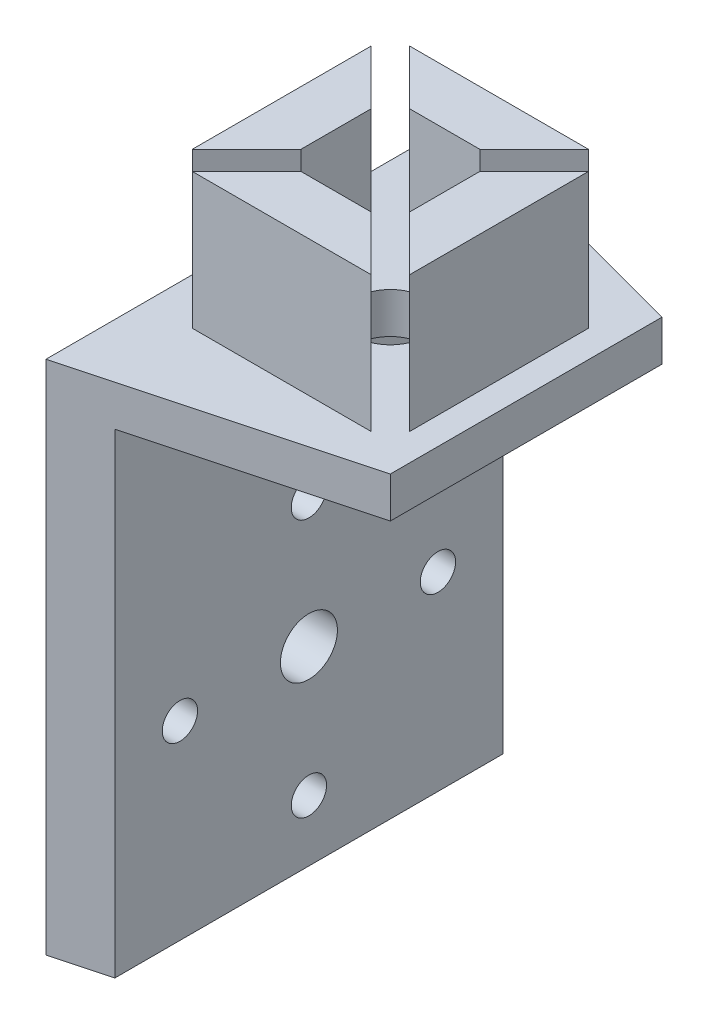
ISO-10303-21;
HEADER;
FILE_DESCRIPTION(('STEP AP214'),'2;1');
FILE_NAME('part.step','',(''),(''),'','','');
FILE_SCHEMA(('AUTOMOTIVE_DESIGN { 1 0 10303 214 1 1 1 1 }'));
ENDSEC;
DATA;
#1=APPLICATION_CONTEXT('core data for automotive mechanical design processes');
#2=APPLICATION_PROTOCOL_DEFINITION('international standard','automotive_design',2000,#1);
#3=PRODUCT_CONTEXT('',#1,'mechanical');
#4=PRODUCT('Part','Part','',(#3));
#5=PRODUCT_RELATED_PRODUCT_CATEGORY('part','',(#4));
#6=PRODUCT_DEFINITION_FORMATION('','',#4);
#7=PRODUCT_DEFINITION_CONTEXT('part definition',#1,'design');
#8=PRODUCT_DEFINITION('design','',#6,#7);
#9=PRODUCT_DEFINITION_SHAPE('','',#8);
#10=(LENGTH_UNIT() NAMED_UNIT(*) SI_UNIT(.MILLI.,.METRE.));
#11=(NAMED_UNIT(*) PLANE_ANGLE_UNIT() SI_UNIT($,.RADIAN.));
#12=(NAMED_UNIT(*) SI_UNIT($,.STERADIAN.) SOLID_ANGLE_UNIT());
#13=UNCERTAINTY_MEASURE_WITH_UNIT(LENGTH_MEASURE(1.E-05),#10,'distance_accuracy_value','');
#14=(GEOMETRIC_REPRESENTATION_CONTEXT(3) GLOBAL_UNCERTAINTY_ASSIGNED_CONTEXT((#13)) GLOBAL_UNIT_ASSIGNED_CONTEXT((#10,
#11,#12)) REPRESENTATION_CONTEXT('',''));
#15=CARTESIAN_POINT('',(0.,0.,0.));
#16=DIRECTION('',(0.,0.,1.));
#17=DIRECTION('',(1.,0.,0.));
#18=AXIS2_PLACEMENT_3D('',#15,#16,#17);
#19=CARTESIAN_POINT('',(0.,-150.,0.));
#20=DIRECTION('',(0.,-1.,0.));
#21=DIRECTION('',(0.,0.,-1.));
#22=AXIS2_PLACEMENT_3D('',#19,#20,#21);
#23=PLANE('',#22);
#24=DIRECTION('',(0.,0.,-1.));
#25=VECTOR('',#24,1.);
#26=CARTESIAN_POINT('',(123.,-150.,0.));
#27=LINE('',#26,#25);
#28=CARTESIAN_POINT('',(123.,-150.,56.585786437627));
#29=VERTEX_POINT('',#28);
#30=CARTESIAN_POINT('',(123.,-150.,43.4142135623731));
#31=VERTEX_POINT('',#30);
#32=EDGE_CURVE('E378',#29,#31,#27,.T.);
#33=ORIENTED_EDGE('',*,*,#32,.F.);
#34=DIRECTION('',(0.707106781186547,0.,0.707106781186548));
#35=VECTOR('',#34,1.);
#36=CARTESIAN_POINT('',(33.2071067811866,-150.,-33.2071067811865));
#37=LINE('',#36,#35);
#38=CARTESIAN_POINT('',(119.,-150.,52.5857864376269));
#39=VERTEX_POINT('',#38);
#40=EDGE_CURVE('E400',#39,#29,#37,.T.);
#41=ORIENTED_EDGE('',*,*,#40,.F.);
#42=DIRECTION('',(0.,0.,1.));
#43=VECTOR('',#42,1.);
#44=CARTESIAN_POINT('',(119.,-150.,0.));
#45=LINE('',#44,#43);
#46=CARTESIAN_POINT('',(119.,-150.,47.4142135623731));
#47=VERTEX_POINT('',#46);
#48=EDGE_CURVE('E403',#47,#39,#45,.T.);
#49=ORIENTED_EDGE('',*,*,#48,.F.);
#50=DIRECTION('',(-0.707106781186547,0.,0.707106781186548));
#51=VECTOR('',#50,1.);
#52=CARTESIAN_POINT('',(83.2071067811866,-150.,83.2071067811866));
#53=LINE('',#52,#51);
#54=EDGE_CURVE('E391',#31,#47,#53,.T.);
#55=ORIENTED_EDGE('',*,*,#54,.F.);
#56=EDGE_LOOP('',(#33,#41,#49,#55));
#57=FACE_BOUND('',#56,.T.);
#58=CARTESIAN_POINT('',(115.,-150.,50.));
#59=DIRECTION('',(0.,-1.,0.));
#60=DIRECTION('',(0.,0.,-1.));
#61=AXIS2_PLACEMENT_3D('',#58,#59,#60);
#62=CIRCLE('',#61,2.50000000000001);
#63=CARTESIAN_POINT('',(115.,-150.,47.5));
#64=VERTEX_POINT('',#63);
#65=EDGE_CURVE('E456',#64,#64,#62,.T.);
#66=ORIENTED_EDGE('',*,*,#65,.T.);
#67=EDGE_LOOP('',(#66));
#68=FACE_BOUND('',#67,.T.);
#69=DIRECTION('',(0.,0.,1.));
#70=VECTOR('',#69,1.);
#71=CARTESIAN_POINT('',(125.,-150.,0.));
#72=LINE('',#71,#70);
#73=CARTESIAN_POINT('',(125.,-150.,40.));
#74=VERTEX_POINT('',#73);
#75=CARTESIAN_POINT('',(125.,-150.,60.));
#76=VERTEX_POINT('',#75);
#77=EDGE_CURVE('E444',#74,#76,#72,.T.);
#78=ORIENTED_EDGE('',*,*,#77,.F.);
#79=DIRECTION('',(0.965925826289068,0.,0.258819045102521));
#80=VECTOR('',#79,1.);
#81=CARTESIAN_POINT('',(94.7450647757216,-150.,31.8932145395987));
#82=LINE('',#81,#80);
#83=CARTESIAN_POINT('',(105.,-150.,34.6410161513775));
#84=VERTEX_POINT('',#83);
#85=EDGE_CURVE('E344',#84,#74,#82,.T.);
#86=ORIENTED_EDGE('',*,*,#85,.F.);
#87=DIRECTION('',(0.,0.,-1.));
#88=VECTOR('',#87,1.);
#89=CARTESIAN_POINT('',(105.,-150.,0.));
#90=LINE('',#89,#88);
#91=CARTESIAN_POINT('',(105.,-150.,65.3589838486225));
#92=VERTEX_POINT('',#91);
#93=EDGE_CURVE('E461',#92,#84,#90,.T.);
#94=ORIENTED_EDGE('',*,*,#93,.F.);
#95=DIRECTION('',(-0.965925826289068,0.,0.258819045102521));
#96=VECTOR('',#95,1.);
#97=CARTESIAN_POINT('',(113.405318813566,-150.,63.1067854604013));
#98=LINE('',#97,#96);
#99=EDGE_CURVE('E338',#76,#92,#98,.T.);
#100=ORIENTED_EDGE('',*,*,#99,.F.);
#101=EDGE_LOOP('',(#78,#86,#94,#100));
#102=FACE_BOUND('',#101,.T.);
#103=DIRECTION('',(1.,0.,0.));
#104=VECTOR('',#103,1.);
#105=CARTESIAN_POINT('',(0.,-150.,58.0000000000001));
#106=LINE('',#105,#104);
#107=CARTESIAN_POINT('',(108.414213562373,-150.,58.0000000000001));
#108=VERTEX_POINT('',#107);
#109=CARTESIAN_POINT('',(121.585786437627,-150.,58.));
#110=VERTEX_POINT('',#109);
#111=EDGE_CURVE('E469',#108,#110,#106,.T.);
#112=ORIENTED_EDGE('',*,*,#111,.F.);
#113=DIRECTION('',(-0.707106781186548,0.,0.707106781186548));
#114=VECTOR('',#113,1.);
#115=CARTESIAN_POINT('',(83.2071067811866,-150.,83.2071067811866));
#116=LINE('',#115,#114);
#117=CARTESIAN_POINT('',(112.414213562373,-150.,54.));
#118=VERTEX_POINT('',#117);
#119=EDGE_CURVE('E482',#118,#108,#116,.T.);
#120=ORIENTED_EDGE('',*,*,#119,.F.);
#121=DIRECTION('',(-1.,0.,0.));
#122=VECTOR('',#121,1.);
#123=CARTESIAN_POINT('',(0.,-150.,54.));
#124=LINE('',#123,#122);
#125=CARTESIAN_POINT('',(117.585786437627,-150.,54.));
#126=VERTEX_POINT('',#125);
#127=EDGE_CURVE('E485',#126,#118,#124,.T.);
#128=ORIENTED_EDGE('',*,*,#127,.F.);
#129=DIRECTION('',(-0.707106781186548,0.,-0.707106781186547));
#130=VECTOR('',#129,1.);
#131=CARTESIAN_POINT('',(31.7928932188134,-150.,-31.7928932188134));
#132=LINE('',#131,#130);
#133=EDGE_CURVE('E474',#110,#126,#132,.T.);
#134=ORIENTED_EDGE('',*,*,#133,.F.);
#135=EDGE_LOOP('',(#112,#120,#128,#134));
#136=FACE_BOUND('',#135,.T.);
#137=DIRECTION('',(0.,0.,1.));
#138=VECTOR('',#137,1.);
#139=CARTESIAN_POINT('',(107.000000000001,-150.,1.06498441743828E-12));
#140=LINE('',#139,#138);
#141=CARTESIAN_POINT('',(107.,-150.,43.4142135623731));
#142=VERTEX_POINT('',#141);
#143=CARTESIAN_POINT('',(107.,-150.,56.585786437627));
#144=VERTEX_POINT('',#143);
#145=EDGE_CURVE('E411',#142,#144,#140,.T.);
#146=ORIENTED_EDGE('',*,*,#145,.F.);
#147=DIRECTION('',(-0.707106781186547,0.,-0.707106781186548));
#148=VECTOR('',#147,1.);
#149=CARTESIAN_POINT('',(31.7928932188135,-150.,-31.7928932188135));
#150=LINE('',#149,#148);
#151=CARTESIAN_POINT('',(111.,-150.,47.4142135623731));
#152=VERTEX_POINT('',#151);
#153=EDGE_CURVE('E433',#152,#142,#150,.T.);
#154=ORIENTED_EDGE('',*,*,#153,.F.);
#155=DIRECTION('',(0.,0.,-1.));
#156=VECTOR('',#155,1.);
#157=CARTESIAN_POINT('',(111.,-150.,0.));
#158=LINE('',#157,#156);
#159=CARTESIAN_POINT('',(111.,-150.,52.5857864376269));
#160=VERTEX_POINT('',#159);
#161=EDGE_CURVE('E436',#160,#152,#158,.T.);
#162=ORIENTED_EDGE('',*,*,#161,.F.);
#163=DIRECTION('',(0.707106781186547,0.,-0.707106781186548));
#164=VECTOR('',#163,1.);
#165=CARTESIAN_POINT('',(81.7928932188135,-150.,81.7928932188134));
#166=LINE('',#165,#164);
#167=EDGE_CURVE('E424',#144,#160,#166,.T.);
#168=ORIENTED_EDGE('',*,*,#167,.F.);
#169=EDGE_LOOP('',(#146,#154,#162,#168));
#170=FACE_BOUND('',#169,.T.);
#171=DIRECTION('',(-1.,0.,0.));
#172=VECTOR('',#171,1.);
#173=CARTESIAN_POINT('',(0.,-150.,42.));
#174=LINE('',#173,#172);
#175=CARTESIAN_POINT('',(121.585786437627,-150.,42.));
#176=VERTEX_POINT('',#175);
#177=CARTESIAN_POINT('',(108.414213562373,-150.,42.));
#178=VERTEX_POINT('',#177);
#179=EDGE_CURVE('E357',#176,#178,#174,.T.);
#180=ORIENTED_EDGE('',*,*,#179,.F.);
#181=DIRECTION('',(0.707106781186548,0.,-0.707106781186547));
#182=VECTOR('',#181,1.);
#183=CARTESIAN_POINT('',(81.7928932188135,-150.,81.7928932188135));
#184=LINE('',#183,#182);
#185=CARTESIAN_POINT('',(117.585786437627,-150.,46.));
#186=VERTEX_POINT('',#185);
#187=EDGE_CURVE('E371',#186,#176,#184,.T.);
#188=ORIENTED_EDGE('',*,*,#187,.F.);
#189=DIRECTION('',(1.,0.,0.));
#190=VECTOR('',#189,1.);
#191=CARTESIAN_POINT('',(0.,-150.,46.));
#192=LINE('',#191,#190);
#193=CARTESIAN_POINT('',(112.414213562373,-150.,46.));
#194=VERTEX_POINT('',#193);
#195=EDGE_CURVE('E187',#194,#186,#192,.T.);
#196=ORIENTED_EDGE('',*,*,#195,.F.);
#197=DIRECTION('',(0.707106781186548,0.,0.707106781186548));
#198=VECTOR('',#197,1.);
#199=CARTESIAN_POINT('',(33.2071067811865,-150.,-33.2071067811865));
#200=LINE('',#199,#198);
#201=EDGE_CURVE('E182',#178,#194,#200,.T.);
#202=ORIENTED_EDGE('',*,*,#201,.F.);
#203=EDGE_LOOP('',(#180,#188,#196,#202));
#204=FACE_BOUND('',#203,.T.);
#205=ADVANCED_FACE('F165',(#57,#68,#102,#136,#170,#204),#23,.F.);
#206=CARTESIAN_POINT('',(0.,-140.,58.0000000000001));
#207=DIRECTION('',(0.,0.,-1.));
#208=DIRECTION('',(-1.,0.,0.));
#209=AXIS2_PLACEMENT_3D('',#206,#207,#208);
#210=PLANE('',#209);
#211=ORIENTED_EDGE('',*,*,#111,.T.);
#212=DIRECTION('',(0.,-1.,0.));
#213=VECTOR('',#212,1.);
#214=CARTESIAN_POINT('',(121.585786437627,-140.,58.));
#215=LINE('',#214,#213);
#216=CARTESIAN_POINT('',(121.585786437627,-140.,58.));
#217=VERTEX_POINT('',#216);
#218=EDGE_CURVE('E12',#217,#110,#215,.T.);
#219=ORIENTED_EDGE('',*,*,#218,.F.);
#220=DIRECTION('',(1.,0.,0.));
#221=VECTOR('',#220,1.);
#222=CARTESIAN_POINT('',(0.,-140.,58.0000000000001));
#223=LINE('',#222,#221);
#224=CARTESIAN_POINT('',(108.414213562373,-140.,58.0000000000001));
#225=VERTEX_POINT('',#224);
#226=EDGE_CURVE('E470',#225,#217,#223,.T.);
#227=ORIENTED_EDGE('',*,*,#226,.F.);
#228=DIRECTION('',(0.,-1.,0.));
#229=VECTOR('',#228,1.);
#230=CARTESIAN_POINT('',(108.414213562373,-140.,58.0000000000001));
#231=LINE('',#230,#229);
#232=EDGE_CURVE('E169',#225,#108,#231,.T.);
#233=ORIENTED_EDGE('',*,*,#232,.T.);
#234=EDGE_LOOP('',(#211,#219,#227,#233));
#235=FACE_BOUND('',#234,.T.);
#236=ADVANCED_FACE('F167',(#235),#210,.F.);
#237=CARTESIAN_POINT('',(31.7928932188134,-140.,-31.7928932188134));
#238=DIRECTION('',(-0.707106781186547,0.,0.707106781186548));
#239=DIRECTION('',(0.707106781186548,0.,0.707106781186547));
#240=AXIS2_PLACEMENT_3D('',#237,#238,#239);
#241=PLANE('',#240);
#242=ORIENTED_EDGE('',*,*,#133,.T.);
#243=DIRECTION('',(0.,-1.,0.));
#244=VECTOR('',#243,1.);
#245=CARTESIAN_POINT('',(117.585786437627,-140.,54.));
#246=LINE('',#245,#244);
#247=CARTESIAN_POINT('',(117.585786437627,-140.,54.));
#248=VERTEX_POINT('',#247);
#249=EDGE_CURVE('E174',#248,#126,#246,.T.);
#250=ORIENTED_EDGE('',*,*,#249,.F.);
#251=DIRECTION('',(-0.707106781186548,0.,-0.707106781186547));
#252=VECTOR('',#251,1.);
#253=CARTESIAN_POINT('',(31.7928932188134,-140.,-31.7928932188134));
#254=LINE('',#253,#252);
#255=EDGE_CURVE('E478',#217,#248,#254,.T.);
#256=ORIENTED_EDGE('',*,*,#255,.F.);
#257=ORIENTED_EDGE('',*,*,#218,.T.);
#258=EDGE_LOOP('',(#242,#250,#256,#257));
#259=FACE_BOUND('',#258,.T.);
#260=ADVANCED_FACE('F509',(#259),#241,.F.);
#261=CARTESIAN_POINT('',(0.,-140.,54.));
#262=DIRECTION('',(0.,0.,1.));
#263=DIRECTION('',(1.,0.,0.));
#264=AXIS2_PLACEMENT_3D('',#261,#262,#263);
#265=PLANE('',#264);
#266=ORIENTED_EDGE('',*,*,#127,.T.);
#267=DIRECTION('',(0.,-1.,0.));
#268=VECTOR('',#267,1.);
#269=CARTESIAN_POINT('',(112.414213562373,-140.,54.));
#270=LINE('',#269,#268);
#271=CARTESIAN_POINT('',(112.414213562373,-140.,54.));
#272=VERTEX_POINT('',#271);
#273=EDGE_CURVE('E491',#272,#118,#270,.T.);
#274=ORIENTED_EDGE('',*,*,#273,.F.);
#275=DIRECTION('',(-1.,0.,0.));
#276=VECTOR('',#275,1.);
#277=CARTESIAN_POINT('',(0.,-140.,54.));
#278=LINE('',#277,#276);
#279=EDGE_CURVE('E476',#248,#272,#278,.T.);
#280=ORIENTED_EDGE('',*,*,#279,.F.);
#281=ORIENTED_EDGE('',*,*,#249,.T.);
#282=EDGE_LOOP('',(#266,#274,#280,#281));
#283=FACE_BOUND('',#282,.T.);
#284=ADVANCED_FACE('F505',(#283),#265,.F.);
#285=CARTESIAN_POINT('',(83.2071067811866,-140.,83.2071067811866));
#286=DIRECTION('',(0.707106781186548,0.,0.707106781186548));
#287=DIRECTION('',(0.707106781186548,0.,-0.707106781186548));
#288=AXIS2_PLACEMENT_3D('',#285,#286,#287);
#289=PLANE('',#288);
#290=ORIENTED_EDGE('',*,*,#119,.T.);
#291=ORIENTED_EDGE('',*,*,#232,.F.);
#292=DIRECTION('',(-0.707106781186548,0.,0.707106781186548));
#293=VECTOR('',#292,1.);
#294=CARTESIAN_POINT('',(83.2071067811866,-140.,83.2071067811866));
#295=LINE('',#294,#293);
#296=EDGE_CURVE('E473',#272,#225,#295,.T.);
#297=ORIENTED_EDGE('',*,*,#296,.F.);
#298=ORIENTED_EDGE('',*,*,#273,.T.);
#299=EDGE_LOOP('',(#290,#291,#297,#298));
#300=FACE_BOUND('',#299,.T.);
#301=ADVANCED_FACE('F501',(#300),#289,.F.);
#302=CARTESIAN_POINT('',(0.,-140.,0.));
#303=DIRECTION('',(0.,-1.,0.));
#304=DIRECTION('',(0.,0.,-1.));
#305=AXIS2_PLACEMENT_3D('',#302,#303,#304);
#306=PLANE('',#305);
#307=ORIENTED_EDGE('',*,*,#226,.T.);
#308=ORIENTED_EDGE('',*,*,#255,.T.);
#309=ORIENTED_EDGE('',*,*,#279,.T.);
#310=ORIENTED_EDGE('',*,*,#296,.T.);
#311=EDGE_LOOP('',(#307,#308,#309,#310));
#312=FACE_BOUND('',#311,.T.);
#313=ADVANCED_FACE('F511',(#312),#306,.F.);
#314=CARTESIAN_POINT('',(115.,-153.,50.));
#315=DIRECTION('',(0.,1.,0.));
#316=DIRECTION('',(0.,0.,1.));
#317=AXIS2_PLACEMENT_3D('',#314,#315,#316);
#318=CYLINDRICAL_SURFACE('',#317,2.50000000000001);
#319=CARTESIAN_POINT('',(115.,-153.,50.));
#320=DIRECTION('',(0.,-1.,0.));
#321=DIRECTION('',(0.,0.,-1.));
#322=AXIS2_PLACEMENT_3D('',#319,#320,#321);
#323=CIRCLE('',#322,2.50000000000001);
#324=CARTESIAN_POINT('',(115.,-153.,47.5));
#325=VERTEX_POINT('',#324);
#326=EDGE_CURVE('E455',#325,#325,#323,.T.);
#327=ORIENTED_EDGE('',*,*,#326,.T.);
#328=EDGE_LOOP('',(#327));
#329=FACE_BOUND('',#328,.T.);
#330=ORIENTED_EDGE('',*,*,#65,.F.);
#331=EDGE_LOOP('',(#330));
#332=FACE_BOUND('',#331,.T.);
#333=ADVANCED_FACE('F513',(#329,#332),#318,.F.);
#334=CARTESIAN_POINT('',(125.,-153.,0.));
#335=DIRECTION('',(-1.,0.,0.));
#336=DIRECTION('',(0.,0.,1.));
#337=AXIS2_PLACEMENT_3D('',#334,#335,#336);
#338=PLANE('',#337);
#339=ORIENTED_EDGE('',*,*,#77,.T.);
#340=DIRECTION('',(0.,1.,0.));
#341=VECTOR('',#340,1.);
#342=CARTESIAN_POINT('',(125.,-153.,60.));
#343=LINE('',#342,#341);
#344=CARTESIAN_POINT('',(125.,-153.,60.));
#345=VERTEX_POINT('',#344);
#346=EDGE_CURVE('E459',#345,#76,#343,.T.);
#347=ORIENTED_EDGE('',*,*,#346,.F.);
#348=DIRECTION('',(0.,0.,1.));
#349=VECTOR('',#348,1.);
#350=CARTESIAN_POINT('',(125.,-153.,0.));
#351=LINE('',#350,#349);
#352=CARTESIAN_POINT('',(125.,-153.,40.));
#353=VERTEX_POINT('',#352);
#354=EDGE_CURVE('E453',#353,#345,#351,.T.);
#355=ORIENTED_EDGE('',*,*,#354,.F.);
#356=DIRECTION('',(0.,1.,0.));
#357=VECTOR('',#356,1.);
#358=CARTESIAN_POINT('',(125.,-153.,40.));
#359=LINE('',#358,#357);
#360=EDGE_CURVE('E466',#353,#74,#359,.T.);
#361=ORIENTED_EDGE('',*,*,#360,.T.);
#362=EDGE_LOOP('',(#339,#347,#355,#361));
#363=FACE_BOUND('',#362,.T.);
#364=ADVANCED_FACE('F519',(#363),#338,.F.);
#365=CARTESIAN_POINT('',(105.,-153.,0.));
#366=DIRECTION('',(1.,0.,0.));
#367=DIRECTION('',(0.,0.,-1.));
#368=AXIS2_PLACEMENT_3D('',#365,#366,#367);
#369=PLANE('',#368);
#370=CARTESIAN_POINT('',(105.,-174.,50.));
#371=DIRECTION('',(1.,0.,0.));
#372=DIRECTION('',(0.,0.,-1.));
#373=AXIS2_PLACEMENT_3D('',#370,#371,#372);
#374=CIRCLE('',#373,2.09999999999999);
#375=CARTESIAN_POINT('',(105.,-174.,47.9));
#376=VERTEX_POINT('',#375);
#377=EDGE_CURVE('E561',#376,#376,#374,.T.);
#378=ORIENTED_EDGE('',*,*,#377,.T.);
#379=EDGE_LOOP('',(#378));
#380=FACE_BOUND('',#379,.T.);
#381=CARTESIAN_POINT('',(105.,-164.5,50.));
#382=DIRECTION('',(1.,0.,0.));
#383=DIRECTION('',(0.,0.,-1.));
#384=AXIS2_PLACEMENT_3D('',#381,#382,#383);
#385=CIRCLE('',#384,1.29999999999999);
#386=CARTESIAN_POINT('',(105.,-164.5,48.7));
#387=VERTEX_POINT('',#386);
#388=EDGE_CURVE('E571',#387,#387,#385,.T.);
#389=ORIENTED_EDGE('',*,*,#388,.T.);
#390=EDGE_LOOP('',(#389));
#391=FACE_BOUND('',#390,.T.);
#392=CARTESIAN_POINT('',(105.,-174.,40.5));
#393=DIRECTION('',(1.,0.,0.));
#394=DIRECTION('',(0.,0.,-1.));
#395=AXIS2_PLACEMENT_3D('',#392,#393,#394);
#396=CIRCLE('',#395,1.29999999999998);
#397=CARTESIAN_POINT('',(105.,-174.,39.2000000000001));
#398=VERTEX_POINT('',#397);
#399=EDGE_CURVE('E568',#398,#398,#396,.T.);
#400=ORIENTED_EDGE('',*,*,#399,.T.);
#401=EDGE_LOOP('',(#400));
#402=FACE_BOUND('',#401,.T.);
#403=CARTESIAN_POINT('',(105.,-183.5,50.));
#404=DIRECTION('',(1.,0.,0.));
#405=DIRECTION('',(0.,0.,-1.));
#406=AXIS2_PLACEMENT_3D('',#403,#404,#405);
#407=CIRCLE('',#406,1.29999999999999);
#408=CARTESIAN_POINT('',(105.,-183.5,48.7));
#409=VERTEX_POINT('',#408);
#410=EDGE_CURVE('E562',#409,#409,#407,.T.);
#411=ORIENTED_EDGE('',*,*,#410,.T.);
#412=EDGE_LOOP('',(#411));
#413=FACE_BOUND('',#412,.T.);
#414=CARTESIAN_POINT('',(105.,-174.,59.5));
#415=DIRECTION('',(1.,0.,0.));
#416=DIRECTION('',(0.,0.,-1.));
#417=AXIS2_PLACEMENT_3D('',#414,#415,#416);
#418=CIRCLE('',#417,1.30000000000001);
#419=CARTESIAN_POINT('',(105.,-174.,58.2));
#420=VERTEX_POINT('',#419);
#421=EDGE_CURVE('E554',#420,#420,#418,.T.);
#422=ORIENTED_EDGE('',*,*,#421,.T.);
#423=EDGE_LOOP('',(#422));
#424=FACE_BOUND('',#423,.T.);
#425=ORIENTED_EDGE('',*,*,#93,.T.);
#426=DIRECTION('',(0.,1.,0.));
#427=VECTOR('',#426,1.);
#428=CARTESIAN_POINT('',(105.,-188.,34.6410161513775));
#429=LINE('',#428,#427);
#430=CARTESIAN_POINT('',(105.,-188.,34.6410161513775));
#431=VERTEX_POINT('',#430);
#432=EDGE_CURVE('E321',#431,#84,#429,.T.);
#433=ORIENTED_EDGE('',*,*,#432,.F.);
#434=DIRECTION('',(0.,0.,-1.));
#435=VECTOR('',#434,1.);
#436=CARTESIAN_POINT('',(105.,-188.,40.));
#437=LINE('',#436,#435);
#438=CARTESIAN_POINT('',(105.,-188.,65.3589838486225));
#439=VERTEX_POINT('',#438);
#440=EDGE_CURVE('E314',#439,#431,#437,.T.);
#441=ORIENTED_EDGE('',*,*,#440,.F.);
#442=DIRECTION('',(0.,-1.,0.));
#443=VECTOR('',#442,1.);
#444=CARTESIAN_POINT('',(105.,-150.,65.3589838486225));
#445=LINE('',#444,#443);
#446=EDGE_CURVE('E318',#92,#439,#445,.T.);
#447=ORIENTED_EDGE('',*,*,#446,.F.);
#448=EDGE_LOOP('',(#425,#433,#441,#447));
#449=FACE_BOUND('',#448,.T.);
#450=ADVANCED_FACE('F316',(#380,#391,#402,#413,#424,#449),#369,.F.);
#451=CARTESIAN_POINT('',(0.,-153.,0.));
#452=DIRECTION('',(0.,-1.,0.));
#453=DIRECTION('',(0.,0.,-1.));
#454=AXIS2_PLACEMENT_3D('',#451,#452,#453);
#455=PLANE('',#454);
#456=DIRECTION('',(0.,0.,1.));
#457=VECTOR('',#456,1.);
#458=CARTESIAN_POINT('',(109.,-153.,40.));
#459=LINE('',#458,#457);
#460=CARTESIAN_POINT('',(109.,-153.,35.712812921102));
#461=VERTEX_POINT('',#460);
#462=CARTESIAN_POINT('',(109.,-153.,64.287187078898));
#463=VERTEX_POINT('',#462);
#464=EDGE_CURVE('E326',#461,#463,#459,.T.);
#465=ORIENTED_EDGE('',*,*,#464,.F.);
#466=DIRECTION('',(-0.965925826289068,0.,-0.258819045102521));
#467=VECTOR('',#466,1.);
#468=CARTESIAN_POINT('',(98.4771155832905,-153.,32.8932145395987));
#469=LINE('',#468,#467);
#470=EDGE_CURVE('E347',#353,#461,#469,.T.);
#471=ORIENTED_EDGE('',*,*,#470,.F.);
#472=ORIENTED_EDGE('',*,*,#354,.T.);
#473=DIRECTION('',(0.965925826289068,0.,-0.258819045102521));
#474=VECTOR('',#473,1.);
#475=CARTESIAN_POINT('',(98.4771155832905,-153.,67.1067854604013));
#476=LINE('',#475,#474);
#477=EDGE_CURVE('E340',#463,#345,#476,.T.);
#478=ORIENTED_EDGE('',*,*,#477,.F.);
#479=EDGE_LOOP('',(#465,#471,#472,#478));
#480=FACE_BOUND('',#479,.T.);
#481=ORIENTED_EDGE('',*,*,#326,.F.);
#482=EDGE_LOOP('',(#481));
#483=FACE_BOUND('',#482,.T.);
#484=ADVANCED_FACE('F534',(#480,#483),#455,.T.);
#485=CARTESIAN_POINT('',(107.000000000001,-140.,1.06498441743828E-12));
#486=DIRECTION('',(1.,0.,0.));
#487=DIRECTION('',(0.,0.,-1.));
#488=AXIS2_PLACEMENT_3D('',#485,#486,#487);
#489=PLANE('',#488);
#490=ORIENTED_EDGE('',*,*,#145,.T.);
#491=DIRECTION('',(0.,-1.,0.));
#492=VECTOR('',#491,1.);
#493=CARTESIAN_POINT('',(107.,-140.,56.585786437627));
#494=LINE('',#493,#492);
#495=CARTESIAN_POINT('',(107.,-140.,56.585786437627));
#496=VERTEX_POINT('',#495);
#497=EDGE_CURVE('E441',#496,#144,#494,.T.);
#498=ORIENTED_EDGE('',*,*,#497,.F.);
#499=DIRECTION('',(0.,0.,1.));
#500=VECTOR('',#499,1.);
#501=CARTESIAN_POINT('',(107.000000000001,-140.,1.06498441743828E-12));
#502=LINE('',#501,#500);
#503=CARTESIAN_POINT('',(107.,-140.,43.4142135623731));
#504=VERTEX_POINT('',#503);
#505=EDGE_CURVE('E420',#504,#496,#502,.T.);
#506=ORIENTED_EDGE('',*,*,#505,.F.);
#507=DIRECTION('',(0.,-1.,0.));
#508=VECTOR('',#507,1.);
#509=CARTESIAN_POINT('',(107.,-140.,43.4142135623731));
#510=LINE('',#509,#508);
#511=EDGE_CURVE('E430',#504,#142,#510,.T.);
#512=ORIENTED_EDGE('',*,*,#511,.T.);
#513=EDGE_LOOP('',(#490,#498,#506,#512));
#514=FACE_BOUND('',#513,.T.);
#515=ADVANCED_FACE('F668',(#514),#489,.F.);
#516=CARTESIAN_POINT('',(81.7928932188135,-140.,81.7928932188134));
#517=DIRECTION('',(-0.707106781186548,0.,-0.707106781186547));
#518=DIRECTION('',(-0.707106781186547,0.,0.707106781186548));
#519=AXIS2_PLACEMENT_3D('',#516,#517,#518);
#520=PLANE('',#519);
#521=ORIENTED_EDGE('',*,*,#167,.T.);
#522=DIRECTION('',(0.,-1.,0.));
#523=VECTOR('',#522,1.);
#524=CARTESIAN_POINT('',(111.,-140.,52.5857864376269));
#525=LINE('',#524,#523);
#526=CARTESIAN_POINT('',(111.,-140.,52.5857864376269));
#527=VERTEX_POINT('',#526);
#528=EDGE_CURVE('E445',#527,#160,#525,.T.);
#529=ORIENTED_EDGE('',*,*,#528,.F.);
#530=DIRECTION('',(0.707106781186547,0.,-0.707106781186548));
#531=VECTOR('',#530,1.);
#532=CARTESIAN_POINT('',(81.7928932188135,-140.,81.7928932188134));
#533=LINE('',#532,#531);
#534=EDGE_CURVE('E428',#496,#527,#533,.T.);
#535=ORIENTED_EDGE('',*,*,#534,.F.);
#536=ORIENTED_EDGE('',*,*,#497,.T.);
#537=EDGE_LOOP('',(#521,#529,#535,#536));
#538=FACE_BOUND('',#537,.T.);
#539=ADVANCED_FACE('F664',(#538),#520,.F.);
#540=CARTESIAN_POINT('',(111.,-140.,0.));
#541=DIRECTION('',(-1.,0.,0.));
#542=DIRECTION('',(0.,0.,1.));
#543=AXIS2_PLACEMENT_3D('',#540,#541,#542);
#544=PLANE('',#543);
#545=ORIENTED_EDGE('',*,*,#161,.T.);
#546=DIRECTION('',(0.,-1.,0.));
#547=VECTOR('',#546,1.);
#548=CARTESIAN_POINT('',(111.,-140.,47.4142135623731));
#549=LINE('',#548,#547);
#550=CARTESIAN_POINT('',(111.,-140.,47.4142135623731));
#551=VERTEX_POINT('',#550);
#552=EDGE_CURVE('E448',#551,#152,#549,.T.);
#553=ORIENTED_EDGE('',*,*,#552,.F.);
#554=DIRECTION('',(0.,0.,-1.));
#555=VECTOR('',#554,1.);
#556=CARTESIAN_POINT('',(111.,-140.,0.));
#557=LINE('',#556,#555);
#558=EDGE_CURVE('E426',#527,#551,#557,.T.);
#559=ORIENTED_EDGE('',*,*,#558,.F.);
#560=ORIENTED_EDGE('',*,*,#528,.T.);
#561=EDGE_LOOP('',(#545,#553,#559,#560));
#562=FACE_BOUND('',#561,.T.);
#563=ADVANCED_FACE('F667',(#562),#544,.F.);
#564=CARTESIAN_POINT('',(31.7928932188135,-140.,-31.7928932188135));
#565=DIRECTION('',(-0.707106781186548,0.,0.707106781186547));
#566=DIRECTION('',(0.707106781186547,0.,0.707106781186548));
#567=AXIS2_PLACEMENT_3D('',#564,#565,#566);
#568=PLANE('',#567);
#569=ORIENTED_EDGE('',*,*,#153,.T.);
#570=ORIENTED_EDGE('',*,*,#511,.F.);
#571=DIRECTION('',(-0.707106781186547,0.,-0.707106781186548));
#572=VECTOR('',#571,1.);
#573=CARTESIAN_POINT('',(31.7928932188135,-140.,-31.7928932188135));
#574=LINE('',#573,#572);
#575=EDGE_CURVE('E423',#551,#504,#574,.T.);
#576=ORIENTED_EDGE('',*,*,#575,.F.);
#577=ORIENTED_EDGE('',*,*,#552,.T.);
#578=EDGE_LOOP('',(#569,#570,#576,#577));
#579=FACE_BOUND('',#578,.T.);
#580=ADVANCED_FACE('F662',(#579),#568,.F.);
#581=CARTESIAN_POINT('',(0.,-140.,0.));
#582=DIRECTION('',(0.,-1.,0.));
#583=DIRECTION('',(0.,0.,-1.));
#584=AXIS2_PLACEMENT_3D('',#581,#582,#583);
#585=PLANE('',#584);
#586=ORIENTED_EDGE('',*,*,#505,.T.);
#587=ORIENTED_EDGE('',*,*,#534,.T.);
#588=ORIENTED_EDGE('',*,*,#558,.T.);
#589=ORIENTED_EDGE('',*,*,#575,.T.);
#590=EDGE_LOOP('',(#586,#587,#588,#589));
#591=FACE_BOUND('',#590,.T.);
#592=ADVANCED_FACE('F658',(#591),#585,.F.);
#593=CARTESIAN_POINT('',(123.,-140.,0.));
#594=DIRECTION('',(-1.,0.,0.));
#595=DIRECTION('',(0.,0.,1.));
#596=AXIS2_PLACEMENT_3D('',#593,#594,#595);
#597=PLANE('',#596);
#598=ORIENTED_EDGE('',*,*,#32,.T.);
#599=DIRECTION('',(0.,-1.,0.));
#600=VECTOR('',#599,1.);
#601=CARTESIAN_POINT('',(123.,-140.,43.4142135623731));
#602=LINE('',#601,#600);
#603=CARTESIAN_POINT('',(123.,-140.,43.4142135623731));
#604=VERTEX_POINT('',#603);
#605=EDGE_CURVE('E408',#604,#31,#602,.T.);
#606=ORIENTED_EDGE('',*,*,#605,.F.);
#607=DIRECTION('',(0.,0.,-1.));
#608=VECTOR('',#607,1.);
#609=CARTESIAN_POINT('',(123.,-140.,0.));
#610=LINE('',#609,#608);
#611=CARTESIAN_POINT('',(123.,-140.,56.585786437627));
#612=VERTEX_POINT('',#611);
#613=EDGE_CURVE('E387',#612,#604,#610,.T.);
#614=ORIENTED_EDGE('',*,*,#613,.F.);
#615=DIRECTION('',(0.,-1.,0.));
#616=VECTOR('',#615,1.);
#617=CARTESIAN_POINT('',(123.,-140.,56.585786437627));
#618=LINE('',#617,#616);
#619=EDGE_CURVE('E397',#612,#29,#618,.T.);
#620=ORIENTED_EDGE('',*,*,#619,.T.);
#621=EDGE_LOOP('',(#598,#606,#614,#620));
#622=FACE_BOUND('',#621,.T.);
#623=ADVANCED_FACE('F648',(#622),#597,.F.);
#624=CARTESIAN_POINT('',(83.2071067811866,-140.,83.2071067811866));
#625=DIRECTION('',(0.707106781186548,0.,0.707106781186547));
#626=DIRECTION('',(0.707106781186547,0.,-0.707106781186548));
#627=AXIS2_PLACEMENT_3D('',#624,#625,#626);
#628=PLANE('',#627);
#629=ORIENTED_EDGE('',*,*,#54,.T.);
#630=DIRECTION('',(0.,-1.,0.));
#631=VECTOR('',#630,1.);
#632=CARTESIAN_POINT('',(119.,-140.,47.4142135623731));
#633=LINE('',#632,#631);
#634=CARTESIAN_POINT('',(119.,-140.,47.4142135623731));
#635=VERTEX_POINT('',#634);
#636=EDGE_CURVE('E412',#635,#47,#633,.T.);
#637=ORIENTED_EDGE('',*,*,#636,.F.);
#638=DIRECTION('',(-0.707106781186547,0.,0.707106781186548));
#639=VECTOR('',#638,1.);
#640=CARTESIAN_POINT('',(83.2071067811866,-140.,83.2071067811866));
#641=LINE('',#640,#639);
#642=EDGE_CURVE('E395',#604,#635,#641,.T.);
#643=ORIENTED_EDGE('',*,*,#642,.F.);
#644=ORIENTED_EDGE('',*,*,#605,.T.);
#645=EDGE_LOOP('',(#629,#637,#643,#644));
#646=FACE_BOUND('',#645,.T.);
#647=ADVANCED_FACE('F644',(#646),#628,.F.);
#648=CARTESIAN_POINT('',(119.,-140.,0.));
#649=DIRECTION('',(1.,0.,0.));
#650=DIRECTION('',(0.,0.,-1.));
#651=AXIS2_PLACEMENT_3D('',#648,#649,#650);
#652=PLANE('',#651);
#653=ORIENTED_EDGE('',*,*,#48,.T.);
#654=DIRECTION('',(0.,-1.,0.));
#655=VECTOR('',#654,1.);
#656=CARTESIAN_POINT('',(119.,-140.,52.5857864376269));
#657=LINE('',#656,#655);
#658=CARTESIAN_POINT('',(119.,-140.,52.5857864376269));
#659=VERTEX_POINT('',#658);
#660=EDGE_CURVE('E415',#659,#39,#657,.T.);
#661=ORIENTED_EDGE('',*,*,#660,.F.);
#662=DIRECTION('',(0.,0.,1.));
#663=VECTOR('',#662,1.);
#664=CARTESIAN_POINT('',(119.,-140.,0.));
#665=LINE('',#664,#663);
#666=EDGE_CURVE('E393',#635,#659,#665,.T.);
#667=ORIENTED_EDGE('',*,*,#666,.F.);
#668=ORIENTED_EDGE('',*,*,#636,.T.);
#669=EDGE_LOOP('',(#653,#661,#667,#668));
#670=FACE_BOUND('',#669,.T.);
#671=ADVANCED_FACE('F647',(#670),#652,.F.);
#672=CARTESIAN_POINT('',(33.2071067811866,-140.,-33.2071067811865));
#673=DIRECTION('',(0.707106781186548,0.,-0.707106781186547));
#674=DIRECTION('',(-0.707106781186547,0.,-0.707106781186548));
#675=AXIS2_PLACEMENT_3D('',#672,#673,#674);
#676=PLANE('',#675);
#677=ORIENTED_EDGE('',*,*,#40,.T.);
#678=ORIENTED_EDGE('',*,*,#619,.F.);
#679=DIRECTION('',(0.707106781186547,0.,0.707106781186548));
#680=VECTOR('',#679,1.);
#681=CARTESIAN_POINT('',(33.2071067811866,-140.,-33.2071067811865));
#682=LINE('',#681,#680);
#683=EDGE_CURVE('E390',#659,#612,#682,.T.);
#684=ORIENTED_EDGE('',*,*,#683,.F.);
#685=ORIENTED_EDGE('',*,*,#660,.T.);
#686=EDGE_LOOP('',(#677,#678,#684,#685));
#687=FACE_BOUND('',#686,.T.);
#688=ADVANCED_FACE('F642',(#687),#676,.F.);
#689=CARTESIAN_POINT('',(0.,-140.,0.));
#690=DIRECTION('',(0.,-1.,0.));
#691=DIRECTION('',(0.,0.,-1.));
#692=AXIS2_PLACEMENT_3D('',#689,#690,#691);
#693=PLANE('',#692);
#694=ORIENTED_EDGE('',*,*,#613,.T.);
#695=ORIENTED_EDGE('',*,*,#642,.T.);
#696=ORIENTED_EDGE('',*,*,#666,.T.);
#697=ORIENTED_EDGE('',*,*,#683,.T.);
#698=EDGE_LOOP('',(#694,#695,#696,#697));
#699=FACE_BOUND('',#698,.T.);
#700=ADVANCED_FACE('F638',(#699),#693,.F.);
#701=CARTESIAN_POINT('',(0.,-140.,42.));
#702=DIRECTION('',(0.,0.,1.));
#703=DIRECTION('',(1.,0.,0.));
#704=AXIS2_PLACEMENT_3D('',#701,#702,#703);
#705=PLANE('',#704);
#706=ORIENTED_EDGE('',*,*,#179,.T.);
#707=DIRECTION('',(0.,-1.,0.));
#708=VECTOR('',#707,1.);
#709=CARTESIAN_POINT('',(108.414213562373,-140.,42.));
#710=LINE('',#709,#708);
#711=CARTESIAN_POINT('',(108.414213562373,-140.,42.));
#712=VERTEX_POINT('',#711);
#713=EDGE_CURVE('E376',#712,#178,#710,.T.);
#714=ORIENTED_EDGE('',*,*,#713,.F.);
#715=DIRECTION('',(-1.,0.,0.));
#716=VECTOR('',#715,1.);
#717=CARTESIAN_POINT('',(0.,-140.,42.));
#718=LINE('',#717,#716);
#719=CARTESIAN_POINT('',(121.585786437627,-140.,42.));
#720=VERTEX_POINT('',#719);
#721=EDGE_CURVE('E359',#720,#712,#718,.T.);
#722=ORIENTED_EDGE('',*,*,#721,.F.);
#723=DIRECTION('',(0.,-1.,0.));
#724=VECTOR('',#723,1.);
#725=CARTESIAN_POINT('',(121.585786437627,-140.,42.));
#726=LINE('',#725,#724);
#727=EDGE_CURVE('E368',#720,#176,#726,.T.);
#728=ORIENTED_EDGE('',*,*,#727,.T.);
#729=EDGE_LOOP('',(#706,#714,#722,#728));
#730=FACE_BOUND('',#729,.T.);
#731=ADVANCED_FACE('F628',(#730),#705,.F.);
#732=CARTESIAN_POINT('',(33.2071067811865,-140.,-33.2071067811865));
#733=DIRECTION('',(0.707106781186548,0.,-0.707106781186548));
#734=DIRECTION('',(-0.707106781186548,0.,-0.707106781186548));
#735=AXIS2_PLACEMENT_3D('',#732,#733,#734);
#736=PLANE('',#735);
#737=ORIENTED_EDGE('',*,*,#201,.T.);
#738=DIRECTION('',(0.,-1.,0.));
#739=VECTOR('',#738,1.);
#740=CARTESIAN_POINT('',(112.414213562373,-140.,46.));
#741=LINE('',#740,#739);
#742=CARTESIAN_POINT('',(112.414213562373,-140.,46.));
#743=VERTEX_POINT('',#742);
#744=EDGE_CURVE('E379',#743,#194,#741,.T.);
#745=ORIENTED_EDGE('',*,*,#744,.F.);
#746=DIRECTION('',(0.707106781186548,0.,0.707106781186548));
#747=VECTOR('',#746,1.);
#748=CARTESIAN_POINT('',(33.2071067811865,-140.,-33.2071067811865));
#749=LINE('',#748,#747);
#750=EDGE_CURVE('E366',#712,#743,#749,.T.);
#751=ORIENTED_EDGE('',*,*,#750,.F.);
#752=ORIENTED_EDGE('',*,*,#713,.T.);
#753=EDGE_LOOP('',(#737,#745,#751,#752));
#754=FACE_BOUND('',#753,.T.);
#755=ADVANCED_FACE('F624',(#754),#736,.F.);
#756=CARTESIAN_POINT('',(0.,-140.,46.));
#757=DIRECTION('',(0.,0.,-1.));
#758=DIRECTION('',(-1.,0.,0.));
#759=AXIS2_PLACEMENT_3D('',#756,#757,#758);
#760=PLANE('',#759);
#761=ORIENTED_EDGE('',*,*,#195,.T.);
#762=DIRECTION('',(0.,-1.,0.));
#763=VECTOR('',#762,1.);
#764=CARTESIAN_POINT('',(117.585786437627,-140.,46.));
#765=LINE('',#764,#763);
#766=CARTESIAN_POINT('',(117.585786437627,-140.,46.));
#767=VERTEX_POINT('',#766);
#768=EDGE_CURVE('E382',#767,#186,#765,.T.);
#769=ORIENTED_EDGE('',*,*,#768,.F.);
#770=DIRECTION('',(1.,0.,0.));
#771=VECTOR('',#770,1.);
#772=CARTESIAN_POINT('',(0.,-140.,46.));
#773=LINE('',#772,#771);
#774=EDGE_CURVE('E364',#743,#767,#773,.T.);
#775=ORIENTED_EDGE('',*,*,#774,.F.);
#776=ORIENTED_EDGE('',*,*,#744,.T.);
#777=EDGE_LOOP('',(#761,#769,#775,#776));
#778=FACE_BOUND('',#777,.T.);
#779=ADVANCED_FACE('F627',(#778),#760,.F.);
#780=CARTESIAN_POINT('',(81.7928932188135,-140.,81.7928932188135));
#781=DIRECTION('',(-0.707106781186547,0.,-0.707106781186548));
#782=DIRECTION('',(-0.707106781186548,0.,0.707106781186547));
#783=AXIS2_PLACEMENT_3D('',#780,#781,#782);
#784=PLANE('',#783);
#785=ORIENTED_EDGE('',*,*,#187,.T.);
#786=ORIENTED_EDGE('',*,*,#727,.F.);
#787=DIRECTION('',(0.707106781186548,0.,-0.707106781186547));
#788=VECTOR('',#787,1.);
#789=CARTESIAN_POINT('',(81.7928932188135,-140.,81.7928932188135));
#790=LINE('',#789,#788);
#791=EDGE_CURVE('E362',#767,#720,#790,.T.);
#792=ORIENTED_EDGE('',*,*,#791,.F.);
#793=ORIENTED_EDGE('',*,*,#768,.T.);
#794=EDGE_LOOP('',(#785,#786,#792,#793));
#795=FACE_BOUND('',#794,.T.);
#796=ADVANCED_FACE('F622',(#795),#784,.F.);
#797=CARTESIAN_POINT('',(0.,-140.,0.));
#798=DIRECTION('',(0.,-1.,0.));
#799=DIRECTION('',(0.,0.,-1.));
#800=AXIS2_PLACEMENT_3D('',#797,#798,#799);
#801=PLANE('',#800);
#802=ORIENTED_EDGE('',*,*,#721,.T.);
#803=ORIENTED_EDGE('',*,*,#750,.T.);
#804=ORIENTED_EDGE('',*,*,#774,.T.);
#805=ORIENTED_EDGE('',*,*,#791,.T.);
#806=EDGE_LOOP('',(#802,#803,#804,#805));
#807=FACE_BOUND('',#806,.T.);
#808=ADVANCED_FACE('F595',(#807),#801,.F.);
#809=CARTESIAN_POINT('',(109.,-188.,40.));
#810=DIRECTION('',(-1.,0.,0.));
#811=DIRECTION('',(0.,0.,1.));
#812=AXIS2_PLACEMENT_3D('',#809,#810,#811);
#813=PLANE('',#812);
#814=CARTESIAN_POINT('',(109.,-174.,50.));
#815=DIRECTION('',(1.,0.,0.));
#816=DIRECTION('',(0.,0.,-1.));
#817=AXIS2_PLACEMENT_3D('',#814,#815,#816);
#818=CIRCLE('',#817,2.09999999999999);
#819=CARTESIAN_POINT('',(109.,-174.,47.9));
#820=VERTEX_POINT('',#819);
#821=EDGE_CURVE('E578',#820,#820,#818,.T.);
#822=ORIENTED_EDGE('',*,*,#821,.F.);
#823=EDGE_LOOP('',(#822));
#824=FACE_BOUND('',#823,.T.);
#825=CARTESIAN_POINT('',(109.,-164.5,50.));
#826=DIRECTION('',(-1.,0.,0.));
#827=DIRECTION('',(0.,0.,1.));
#828=AXIS2_PLACEMENT_3D('',#825,#826,#827);
#829=CIRCLE('',#828,1.29999999999999);
#830=CARTESIAN_POINT('',(109.,-164.5,51.3));
#831=VERTEX_POINT('',#830);
#832=EDGE_CURVE('E552',#831,#831,#829,.T.);
#833=ORIENTED_EDGE('',*,*,#832,.T.);
#834=EDGE_LOOP('',(#833));
#835=FACE_BOUND('',#834,.T.);
#836=CARTESIAN_POINT('',(109.,-174.,40.5));
#837=DIRECTION('',(-1.,0.,0.));
#838=DIRECTION('',(0.,0.,1.));
#839=AXIS2_PLACEMENT_3D('',#836,#837,#838);
#840=CIRCLE('',#839,1.29999999999998);
#841=CARTESIAN_POINT('',(109.,-174.,41.8));
#842=VERTEX_POINT('',#841);
#843=EDGE_CURVE('E565',#842,#842,#840,.T.);
#844=ORIENTED_EDGE('',*,*,#843,.T.);
#845=EDGE_LOOP('',(#844));
#846=FACE_BOUND('',#845,.T.);
#847=CARTESIAN_POINT('',(109.,-183.5,50.));
#848=DIRECTION('',(-1.,0.,0.));
#849=DIRECTION('',(0.,0.,1.));
#850=AXIS2_PLACEMENT_3D('',#847,#848,#849);
#851=CIRCLE('',#850,1.29999999999999);
#852=CARTESIAN_POINT('',(109.,-183.5,51.3));
#853=VERTEX_POINT('',#852);
#854=EDGE_CURVE('E557',#853,#853,#851,.T.);
#855=ORIENTED_EDGE('',*,*,#854,.T.);
#856=EDGE_LOOP('',(#855));
#857=FACE_BOUND('',#856,.T.);
#858=CARTESIAN_POINT('',(109.,-174.,59.5));
#859=DIRECTION('',(-1.,0.,0.));
#860=DIRECTION('',(0.,0.,1.));
#861=AXIS2_PLACEMENT_3D('',#858,#859,#860);
#862=CIRCLE('',#861,1.30000000000001);
#863=CARTESIAN_POINT('',(109.,-174.,60.8));
#864=VERTEX_POINT('',#863);
#865=EDGE_CURVE('E558',#864,#864,#862,.T.);
#866=ORIENTED_EDGE('',*,*,#865,.T.);
#867=EDGE_LOOP('',(#866));
#868=FACE_BOUND('',#867,.T.);
#869=ORIENTED_EDGE('',*,*,#464,.T.);
#870=DIRECTION('',(0.,1.,0.));
#871=VECTOR('',#870,1.);
#872=CARTESIAN_POINT('',(109.,-188.,64.287187078898));
#873=LINE('',#872,#871);
#874=CARTESIAN_POINT('',(109.,-188.,64.287187078898));
#875=VERTEX_POINT('',#874);
#876=EDGE_CURVE('E549',#875,#463,#873,.T.);
#877=ORIENTED_EDGE('',*,*,#876,.F.);
#878=DIRECTION('',(0.,0.,1.));
#879=VECTOR('',#878,1.);
#880=CARTESIAN_POINT('',(109.,-188.,40.));
#881=LINE('',#880,#879);
#882=CARTESIAN_POINT('',(109.,-188.,35.712812921102));
#883=VERTEX_POINT('',#882);
#884=EDGE_CURVE('E325',#883,#875,#881,.T.);
#885=ORIENTED_EDGE('',*,*,#884,.F.);
#886=DIRECTION('',(0.,-1.,0.));
#887=VECTOR('',#886,1.);
#888=CARTESIAN_POINT('',(109.,-188.,35.712812921102));
#889=LINE('',#888,#887);
#890=EDGE_CURVE('E351',#461,#883,#889,.T.);
#891=ORIENTED_EDGE('',*,*,#890,.F.);
#892=EDGE_LOOP('',(#869,#877,#885,#891));
#893=FACE_BOUND('',#892,.T.);
#894=ADVANCED_FACE('F592',(#824,#835,#846,#857,#868,#893),#813,.F.);
#895=CARTESIAN_POINT('',(0.,-188.,0.));
#896=DIRECTION('',(0.,1.,0.));
#897=DIRECTION('',(0.,0.,1.));
#898=AXIS2_PLACEMENT_3D('',#895,#896,#897);
#899=PLANE('',#898);
#900=ORIENTED_EDGE('',*,*,#440,.T.);
#901=DIRECTION('',(-0.965925826289068,0.,-0.258819045102521));
#902=VECTOR('',#901,1.);
#903=CARTESIAN_POINT('',(94.7450647757216,-188.,31.8932145395987));
#904=LINE('',#903,#902);
#905=EDGE_CURVE('E349',#883,#431,#904,.T.);
#906=ORIENTED_EDGE('',*,*,#905,.F.);
#907=ORIENTED_EDGE('',*,*,#884,.T.);
#908=DIRECTION('',(0.965925826289068,0.,-0.258819045102521));
#909=VECTOR('',#908,1.);
#910=CARTESIAN_POINT('',(94.7450647757216,-188.,68.1067854604013));
#911=LINE('',#910,#909);
#912=EDGE_CURVE('E329',#439,#875,#911,.T.);
#913=ORIENTED_EDGE('',*,*,#912,.F.);
#914=EDGE_LOOP('',(#900,#906,#907,#913));
#915=FACE_BOUND('',#914,.T.);
#916=ADVANCED_FACE('F330',(#915),#899,.F.);
#917=CARTESIAN_POINT('',(-1.6265877365274,0.,6.0705080756887));
#918=DIRECTION('',(0.258819045102521,0.,-0.965925826289068));
#919=DIRECTION('',(-0.965925826289068,0.,-0.258819045102521));
#920=AXIS2_PLACEMENT_3D('',#917,#918,#919);
#921=PLANE('',#920);
#922=ORIENTED_EDGE('',*,*,#432,.T.);
#923=ORIENTED_EDGE('',*,*,#85,.T.);
#924=ORIENTED_EDGE('',*,*,#360,.F.);
#925=ORIENTED_EDGE('',*,*,#470,.T.);
#926=ORIENTED_EDGE('',*,*,#890,.T.);
#927=ORIENTED_EDGE('',*,*,#905,.T.);
#928=EDGE_LOOP('',(#922,#923,#924,#925,#926,#927));
#929=FACE_BOUND('',#928,.T.);
#930=ADVANCED_FACE('F609',(#929),#921,.T.);
#931=CARTESIAN_POINT('',(23.3734122634726,0.,87.2307621135332));
#932=DIRECTION('',(0.258819045102521,0.,0.965925826289068));
#933=DIRECTION('',(0.965925826289068,0.,-0.258819045102521));
#934=AXIS2_PLACEMENT_3D('',#931,#932,#933);
#935=PLANE('',#934);
#936=ORIENTED_EDGE('',*,*,#876,.T.);
#937=ORIENTED_EDGE('',*,*,#477,.T.);
#938=ORIENTED_EDGE('',*,*,#346,.T.);
#939=ORIENTED_EDGE('',*,*,#99,.T.);
#940=ORIENTED_EDGE('',*,*,#446,.T.);
#941=ORIENTED_EDGE('',*,*,#912,.T.);
#942=EDGE_LOOP('',(#936,#937,#938,#939,#940,#941));
#943=FACE_BOUND('',#942,.T.);
#944=ADVANCED_FACE('F335',(#943),#935,.T.);
#945=CARTESIAN_POINT('',(112.67695526217,-174.,59.5));
#946=DIRECTION('',(-1.,0.,0.));
#947=DIRECTION('',(0.,0.,1.));
#948=AXIS2_PLACEMENT_3D('',#945,#946,#947);
#949=CYLINDRICAL_SURFACE('',#948,1.30000000000001);
#950=ORIENTED_EDGE('',*,*,#865,.F.);
#951=EDGE_LOOP('',(#950));
#952=FACE_BOUND('',#951,.T.);
#953=ORIENTED_EDGE('',*,*,#421,.F.);
#954=EDGE_LOOP('',(#953));
#955=FACE_BOUND('',#954,.T.);
#956=ADVANCED_FACE('F615',(#952,#955),#949,.F.);
#957=CARTESIAN_POINT('',(112.67695526217,-183.5,50.));
#958=DIRECTION('',(-1.,0.,0.));
#959=DIRECTION('',(0.,0.,1.));
#960=AXIS2_PLACEMENT_3D('',#957,#958,#959);
#961=CYLINDRICAL_SURFACE('',#960,1.29999999999999);
#962=ORIENTED_EDGE('',*,*,#854,.F.);
#963=EDGE_LOOP('',(#962));
#964=FACE_BOUND('',#963,.T.);
#965=ORIENTED_EDGE('',*,*,#410,.F.);
#966=EDGE_LOOP('',(#965));
#967=FACE_BOUND('',#966,.T.);
#968=ADVANCED_FACE('F714',(#964,#967),#961,.F.);
#969=CARTESIAN_POINT('',(112.67695526217,-174.,40.5));
#970=DIRECTION('',(-1.,0.,0.));
#971=DIRECTION('',(0.,0.,1.));
#972=AXIS2_PLACEMENT_3D('',#969,#970,#971);
#973=CYLINDRICAL_SURFACE('',#972,1.29999999999998);
#974=ORIENTED_EDGE('',*,*,#843,.F.);
#975=EDGE_LOOP('',(#974));
#976=FACE_BOUND('',#975,.T.);
#977=ORIENTED_EDGE('',*,*,#399,.F.);
#978=EDGE_LOOP('',(#977));
#979=FACE_BOUND('',#978,.T.);
#980=ADVANCED_FACE('F722',(#976,#979),#973,.F.);
#981=CARTESIAN_POINT('',(112.67695526217,-164.5,50.));
#982=DIRECTION('',(-1.,0.,0.));
#983=DIRECTION('',(0.,0.,1.));
#984=AXIS2_PLACEMENT_3D('',#981,#982,#983);
#985=CYLINDRICAL_SURFACE('',#984,1.29999999999999);
#986=ORIENTED_EDGE('',*,*,#832,.F.);
#987=EDGE_LOOP('',(#986));
#988=FACE_BOUND('',#987,.T.);
#989=ORIENTED_EDGE('',*,*,#388,.F.);
#990=EDGE_LOOP('',(#989));
#991=FACE_BOUND('',#990,.T.);
#992=ADVANCED_FACE('F588',(#988,#991),#985,.F.);
#993=CARTESIAN_POINT('',(105.,-174.,50.));
#994=DIRECTION('',(1.,0.,0.));
#995=DIRECTION('',(0.,0.,-1.));
#996=AXIS2_PLACEMENT_3D('',#993,#994,#995);
#997=CYLINDRICAL_SURFACE('',#996,2.09999999999999);
#998=ORIENTED_EDGE('',*,*,#377,.F.);
#999=EDGE_LOOP('',(#998));
#1000=FACE_BOUND('',#999,.T.);
#1001=ORIENTED_EDGE('',*,*,#821,.T.);
#1002=EDGE_LOOP('',(#1001));
#1003=FACE_BOUND('',#1002,.T.);
#1004=ADVANCED_FACE('F585',(#1000,#1003),#997,.F.);
#1005=CLOSED_SHELL('',(#205,#236,#260,#284,#301,#313,#333,#364,#450,#484,#515,#539,#563,#580,
#592,#623,#647,#671,#688,#700,#731,#755,#779,#796,#808,#894,#916,#930,#944,#956,#968,#980,#992,#1004));
#1006=MANIFOLD_SOLID_BREP('B2',#1005);
#1007=ADVANCED_BREP_SHAPE_REPRESENTATION('',(#18,#1006),#14);
#1008=SHAPE_DEFINITION_REPRESENTATION(#9,#1007);
ENDSEC;
END-ISO-10303-21;
